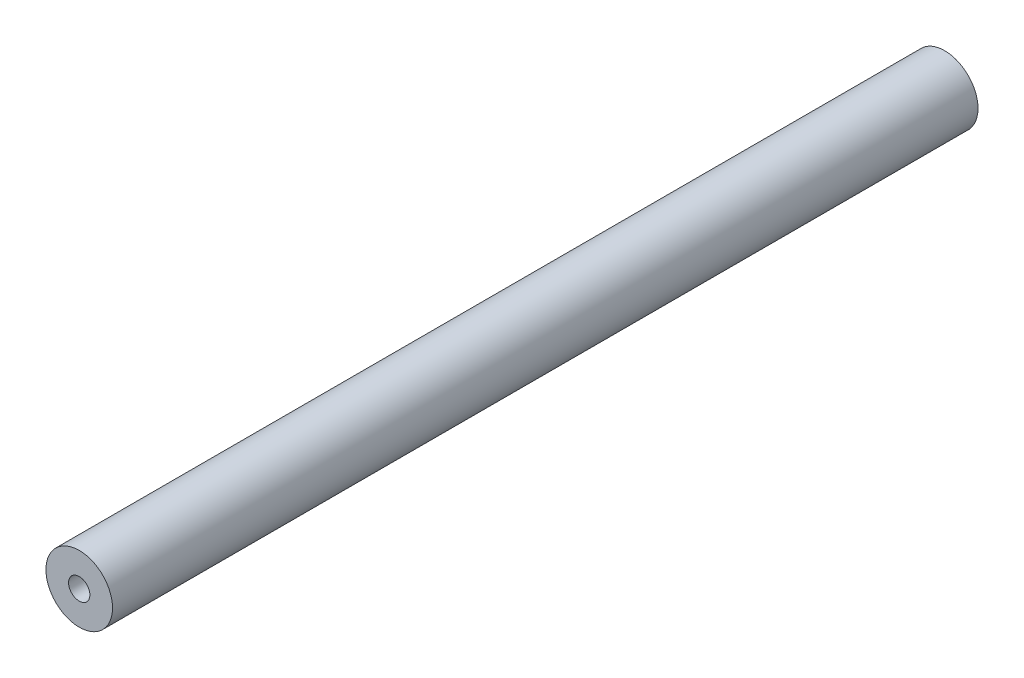
ISO-10303-21;
HEADER;
FILE_DESCRIPTION(('STEP AP214'),'2;1');
FILE_NAME('part.step','',(''),(''),'','','');
FILE_SCHEMA(('AUTOMOTIVE_DESIGN { 1 0 10303 214 1 1 1 1 }'));
ENDSEC;
DATA;
#1=APPLICATION_CONTEXT('core data for automotive mechanical design processes');
#2=APPLICATION_PROTOCOL_DEFINITION('international standard','automotive_design',2000,#1);
#3=PRODUCT_CONTEXT('',#1,'mechanical');
#4=PRODUCT('Part','Part','',(#3));
#5=PRODUCT_RELATED_PRODUCT_CATEGORY('part','',(#4));
#6=PRODUCT_DEFINITION_FORMATION('','',#4);
#7=PRODUCT_DEFINITION_CONTEXT('part definition',#1,'design');
#8=PRODUCT_DEFINITION('design','',#6,#7);
#9=PRODUCT_DEFINITION_SHAPE('','',#8);
#10=(LENGTH_UNIT() NAMED_UNIT(*) SI_UNIT(.MILLI.,.METRE.));
#11=(NAMED_UNIT(*) PLANE_ANGLE_UNIT() SI_UNIT($,.RADIAN.));
#12=(NAMED_UNIT(*) SI_UNIT($,.STERADIAN.) SOLID_ANGLE_UNIT());
#13=UNCERTAINTY_MEASURE_WITH_UNIT(LENGTH_MEASURE(1.E-05),#10,'distance_accuracy_value','');
#14=(GEOMETRIC_REPRESENTATION_CONTEXT(3) GLOBAL_UNCERTAINTY_ASSIGNED_CONTEXT((#13)) GLOBAL_UNIT_ASSIGNED_CONTEXT((#10,
#11,#12)) REPRESENTATION_CONTEXT('',''));
#15=CARTESIAN_POINT('',(0.,0.,0.));
#16=DIRECTION('',(0.,0.,1.));
#17=DIRECTION('',(1.,0.,0.));
#18=AXIS2_PLACEMENT_3D('',#15,#16,#17);
#19=CARTESIAN_POINT('',(0.,0.,165.1));
#20=DIRECTION('',(0.,0.,1.));
#21=DIRECTION('',(1.,0.,0.));
#22=AXIS2_PLACEMENT_3D('',#19,#20,#21);
#23=PLANE('',#22);
#24=CARTESIAN_POINT('',(0.,0.,165.1));
#25=DIRECTION('',(0.,0.,1.));
#26=DIRECTION('',(1.,0.,0.));
#27=AXIS2_PLACEMENT_3D('',#24,#25,#26);
#28=CIRCLE('',#27,6.35);
#29=CARTESIAN_POINT('',(6.35,0.,165.1));
#30=VERTEX_POINT('',#29);
#31=EDGE_CURVE('E10',#30,#30,#28,.T.);
#32=ORIENTED_EDGE('',*,*,#31,.T.);
#33=EDGE_LOOP('',(#32));
#34=FACE_BOUND('',#33,.T.);
#35=CARTESIAN_POINT('',(0.,0.,165.1));
#36=DIRECTION('',(0.,0.,1.));
#37=DIRECTION('',(1.,0.,0.));
#38=AXIS2_PLACEMENT_3D('',#35,#36,#37);
#39=CIRCLE('',#38,2.032);
#40=CARTESIAN_POINT('',(2.032,0.,165.1));
#41=VERTEX_POINT('',#40);
#42=EDGE_CURVE('E48',#41,#41,#39,.T.);
#43=ORIENTED_EDGE('',*,*,#42,.F.);
#44=EDGE_LOOP('',(#43));
#45=FACE_BOUND('',#44,.T.);
#46=ADVANCED_FACE('F40',(#34,#45),#23,.T.);
#47=CARTESIAN_POINT('',(0.,0.,0.));
#48=DIRECTION('',(0.,0.,1.));
#49=DIRECTION('',(1.,0.,0.));
#50=AXIS2_PLACEMENT_3D('',#47,#48,#49);
#51=PLANE('',#50);
#52=CARTESIAN_POINT('',(0.,0.,0.));
#53=DIRECTION('',(0.,0.,1.));
#54=DIRECTION('',(1.,0.,0.));
#55=AXIS2_PLACEMENT_3D('',#52,#53,#54);
#56=CIRCLE('',#55,6.35);
#57=CARTESIAN_POINT('',(6.35,0.,0.));
#58=VERTEX_POINT('',#57);
#59=EDGE_CURVE('E41',#58,#58,#56,.T.);
#60=ORIENTED_EDGE('',*,*,#59,.F.);
#61=EDGE_LOOP('',(#60));
#62=FACE_BOUND('',#61,.T.);
#63=CARTESIAN_POINT('',(0.,0.,0.));
#64=DIRECTION('',(0.,0.,1.));
#65=DIRECTION('',(1.,0.,0.));
#66=AXIS2_PLACEMENT_3D('',#63,#64,#65);
#67=CIRCLE('',#66,2.032);
#68=CARTESIAN_POINT('',(2.032,0.,0.));
#69=VERTEX_POINT('',#68);
#70=EDGE_CURVE('E49',#69,#69,#67,.T.);
#71=ORIENTED_EDGE('',*,*,#70,.T.);
#72=EDGE_LOOP('',(#71));
#73=FACE_BOUND('',#72,.T.);
#74=ADVANCED_FACE('F58',(#62,#73),#51,.F.);
#75=CARTESIAN_POINT('',(0.,0.,165.1));
#76=DIRECTION('',(0.,0.,-1.));
#77=DIRECTION('',(-1.,0.,0.));
#78=AXIS2_PLACEMENT_3D('',#75,#76,#77);
#79=CYLINDRICAL_SURFACE('',#78,6.35);
#80=ORIENTED_EDGE('',*,*,#31,.F.);
#81=EDGE_LOOP('',(#80));
#82=FACE_BOUND('',#81,.T.);
#83=ORIENTED_EDGE('',*,*,#59,.T.);
#84=EDGE_LOOP('',(#83));
#85=FACE_BOUND('',#84,.T.);
#86=ADVANCED_FACE('F39',(#82,#85),#79,.T.);
#87=CARTESIAN_POINT('',(0.,0.,165.1));
#88=DIRECTION('',(0.,0.,-1.));
#89=DIRECTION('',(-1.,0.,0.));
#90=AXIS2_PLACEMENT_3D('',#87,#88,#89);
#91=CYLINDRICAL_SURFACE('',#90,2.032);
#92=ORIENTED_EDGE('',*,*,#42,.T.);
#93=EDGE_LOOP('',(#92));
#94=FACE_BOUND('',#93,.T.);
#95=ORIENTED_EDGE('',*,*,#70,.F.);
#96=EDGE_LOOP('',(#95));
#97=FACE_BOUND('',#96,.T.);
#98=ADVANCED_FACE('F57',(#94,#97),#91,.F.);
#99=CLOSED_SHELL('',(#46,#74,#86,#98));
#100=MANIFOLD_SOLID_BREP('B2',#99);
#101=ADVANCED_BREP_SHAPE_REPRESENTATION('',(#18,#100),#14);
#102=SHAPE_DEFINITION_REPRESENTATION(#9,#101);
ENDSEC;
END-ISO-10303-21;
